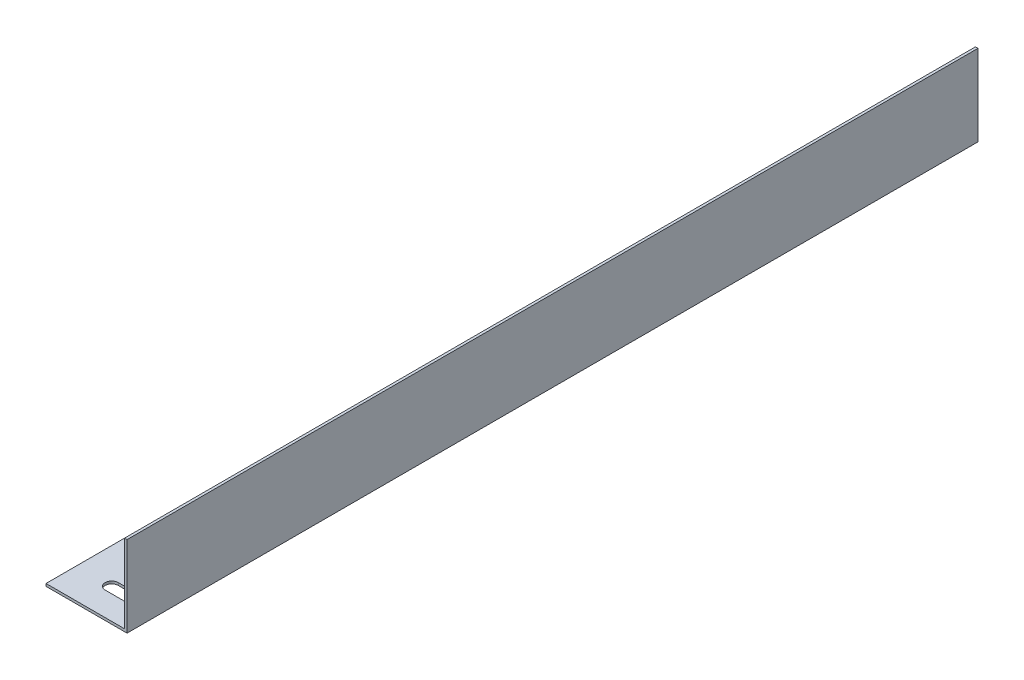
ISO-10303-21;
HEADER;
FILE_DESCRIPTION(('STEP AP214'),'2;1');
FILE_NAME('part.step','',(''),(''),'','','');
FILE_SCHEMA(('AUTOMOTIVE_DESIGN { 1 0 10303 214 1 1 1 1 }'));
ENDSEC;
DATA;
#1=APPLICATION_CONTEXT('core data for automotive mechanical design processes');
#2=APPLICATION_PROTOCOL_DEFINITION('international standard','automotive_design',2000,#1);
#3=PRODUCT_CONTEXT('',#1,'mechanical');
#4=PRODUCT('Part','Part','',(#3));
#5=PRODUCT_RELATED_PRODUCT_CATEGORY('part','',(#4));
#6=PRODUCT_DEFINITION_FORMATION('','',#4);
#7=PRODUCT_DEFINITION_CONTEXT('part definition',#1,'design');
#8=PRODUCT_DEFINITION('design','',#6,#7);
#9=PRODUCT_DEFINITION_SHAPE('','',#8);
#10=(LENGTH_UNIT() NAMED_UNIT(*) SI_UNIT(.MILLI.,.METRE.));
#11=(NAMED_UNIT(*) PLANE_ANGLE_UNIT() SI_UNIT($,.RADIAN.));
#12=(NAMED_UNIT(*) SI_UNIT($,.STERADIAN.) SOLID_ANGLE_UNIT());
#13=UNCERTAINTY_MEASURE_WITH_UNIT(LENGTH_MEASURE(1.E-05),#10,'distance_accuracy_value','');
#14=(GEOMETRIC_REPRESENTATION_CONTEXT(3) GLOBAL_UNCERTAINTY_ASSIGNED_CONTEXT((#13)) GLOBAL_UNIT_ASSIGNED_CONTEXT((#10,
#11,#12)) REPRESENTATION_CONTEXT('',''));
#15=CARTESIAN_POINT('',(0.,0.,0.));
#16=DIRECTION('',(0.,0.,1.));
#17=DIRECTION('',(1.,0.,0.));
#18=AXIS2_PLACEMENT_3D('',#15,#16,#17);
#19=CARTESIAN_POINT('',(0.,1.5875,533.4));
#20=DIRECTION('',(1.,0.,0.));
#21=DIRECTION('',(0.,1.,0.));
#22=AXIS2_PLACEMENT_3D('',#19,#20,#21);
#23=PLANE('',#22);
#24=DIRECTION('',(0.,-1.,0.));
#25=VECTOR('',#24,1.);
#26=CARTESIAN_POINT('',(0.,1.5875,0.));
#27=LINE('',#26,#25);
#28=CARTESIAN_POINT('',(0.,1.5875,0.));
#29=VERTEX_POINT('',#28);
#30=CARTESIAN_POINT('',(0.,0.,0.));
#31=VERTEX_POINT('',#30);
#32=EDGE_CURVE('E163',#29,#31,#27,.T.);
#33=ORIENTED_EDGE('',*,*,#32,.T.);
#34=DIRECTION('',(0.,0.,-1.));
#35=VECTOR('',#34,1.);
#36=CARTESIAN_POINT('',(0.,0.,533.4));
#37=LINE('',#36,#35);
#38=CARTESIAN_POINT('',(0.,0.,533.4));
#39=VERTEX_POINT('',#38);
#40=EDGE_CURVE('E189',#39,#31,#37,.T.);
#41=ORIENTED_EDGE('',*,*,#40,.F.);
#42=DIRECTION('',(0.,-1.,0.));
#43=VECTOR('',#42,1.);
#44=CARTESIAN_POINT('',(0.,1.5875,533.4));
#45=LINE('',#44,#43);
#46=CARTESIAN_POINT('',(0.,1.5875,533.4));
#47=VERTEX_POINT('',#46);
#48=EDGE_CURVE('E148',#47,#39,#45,.T.);
#49=ORIENTED_EDGE('',*,*,#48,.F.);
#50=DIRECTION('',(0.,0.,-1.));
#51=VECTOR('',#50,1.);
#52=CARTESIAN_POINT('',(0.,1.5875,533.4));
#53=LINE('',#52,#51);
#54=EDGE_CURVE('E162',#47,#29,#53,.T.);
#55=ORIENTED_EDGE('',*,*,#54,.T.);
#56=EDGE_LOOP('',(#33,#41,#49,#55));
#57=FACE_BOUND('',#56,.T.);
#58=ADVANCED_FACE('F32',(#57),#23,.F.);
#59=CARTESIAN_POINT('',(0.,0.,533.4));
#60=DIRECTION('',(0.,1.,0.));
#61=DIRECTION('',(0.,0.,1.));
#62=AXIS2_PLACEMENT_3D('',#59,#60,#61);
#63=PLANE('',#62);
#64=DIRECTION('',(1.,0.,0.));
#65=VECTOR('',#64,1.);
#66=CARTESIAN_POINT('',(22.1614999999999,0.,510.2479));
#67=LINE('',#66,#65);
#68=CARTESIAN_POINT('',(22.1614999999999,0.,510.2479));
#69=VERTEX_POINT('',#68);
#70=CARTESIAN_POINT('',(34.8614999999999,0.,510.2479));
#71=VERTEX_POINT('',#70);
#72=EDGE_CURVE('E120',#69,#71,#67,.T.);
#73=ORIENTED_EDGE('',*,*,#72,.F.);
#74=CARTESIAN_POINT('',(22.1614999999999,0.,514.35));
#75=DIRECTION('',(0.,-1.,0.));
#76=DIRECTION('',(0.,0.,-1.));
#77=AXIS2_PLACEMENT_3D('',#74,#75,#76);
#78=CIRCLE('',#77,4.10209999999989);
#79=CARTESIAN_POINT('',(22.1614999999999,0.,518.4521));
#80=VERTEX_POINT('',#79);
#81=EDGE_CURVE('E46',#80,#69,#78,.T.);
#82=ORIENTED_EDGE('',*,*,#81,.F.);
#83=DIRECTION('',(-1.,0.,0.));
#84=VECTOR('',#83,1.);
#85=CARTESIAN_POINT('',(22.1614999999999,0.,518.4521));
#86=LINE('',#85,#84);
#87=CARTESIAN_POINT('',(34.8614999999999,0.,518.4521));
#88=VERTEX_POINT('',#87);
#89=EDGE_CURVE('E127',#88,#80,#86,.T.);
#90=ORIENTED_EDGE('',*,*,#89,.F.);
#91=CARTESIAN_POINT('',(34.8614999999999,0.,514.35));
#92=DIRECTION('',(0.,-1.,0.));
#93=DIRECTION('',(0.,0.,-1.));
#94=AXIS2_PLACEMENT_3D('',#91,#92,#93);
#95=CIRCLE('',#94,4.1021);
#96=EDGE_CURVE('E111',#71,#88,#95,.T.);
#97=ORIENTED_EDGE('',*,*,#96,.F.);
#98=EDGE_LOOP('',(#73,#82,#90,#97));
#99=FACE_BOUND('',#98,.T.);
#100=CARTESIAN_POINT('',(22.1614999999999,0.,19.05));
#101=DIRECTION('',(0.,-1.,0.));
#102=DIRECTION('',(0.,0.,1.));
#103=AXIS2_PLACEMENT_3D('',#100,#101,#102);
#104=CIRCLE('',#103,4.10210000000001);
#105=CARTESIAN_POINT('',(22.1614999999999,0.,23.1521));
#106=VERTEX_POINT('',#105);
#107=EDGE_CURVE('E134',#106,#106,#104,.T.);
#108=ORIENTED_EDGE('',*,*,#107,.F.);
#109=EDGE_LOOP('',(#108));
#110=FACE_BOUND('',#109,.T.);
#111=CARTESIAN_POINT('',(22.1614999999999,0.,57.15));
#112=DIRECTION('',(0.,-1.,0.));
#113=DIRECTION('',(0.,0.,1.));
#114=AXIS2_PLACEMENT_3D('',#111,#112,#113);
#115=CIRCLE('',#114,4.10210000000001);
#116=CARTESIAN_POINT('',(22.1614999999999,0.,61.2521));
#117=VERTEX_POINT('',#116);
#118=EDGE_CURVE('E140',#117,#117,#115,.T.);
#119=ORIENTED_EDGE('',*,*,#118,.F.);
#120=EDGE_LOOP('',(#119));
#121=FACE_BOUND('',#120,.T.);
#122=CARTESIAN_POINT('',(22.1614999999999,0.,476.25));
#123=DIRECTION('',(0.,-1.,0.));
#124=DIRECTION('',(0.,0.,-1.));
#125=AXIS2_PLACEMENT_3D('',#122,#123,#124);
#126=CIRCLE('',#125,4.10210000000001);
#127=CARTESIAN_POINT('',(22.1614999999999,0.,472.1479));
#128=VERTEX_POINT('',#127);
#129=EDGE_CURVE('E144',#128,#128,#126,.T.);
#130=ORIENTED_EDGE('',*,*,#129,.F.);
#131=EDGE_LOOP('',(#130));
#132=FACE_BOUND('',#131,.T.);
#133=DIRECTION('',(1.,0.,0.));
#134=VECTOR('',#133,1.);
#135=CARTESIAN_POINT('',(0.,0.,0.));
#136=LINE('',#135,#134);
#137=CARTESIAN_POINT('',(50.8,0.,0.));
#138=VERTEX_POINT('',#137);
#139=EDGE_CURVE('E166',#31,#138,#136,.T.);
#140=ORIENTED_EDGE('',*,*,#139,.T.);
#141=DIRECTION('',(0.,0.,-1.));
#142=VECTOR('',#141,1.);
#143=CARTESIAN_POINT('',(50.8,0.,533.4));
#144=LINE('',#143,#142);
#145=CARTESIAN_POINT('',(50.8,0.,533.4));
#146=VERTEX_POINT('',#145);
#147=EDGE_CURVE('E186',#146,#138,#144,.T.);
#148=ORIENTED_EDGE('',*,*,#147,.F.);
#149=DIRECTION('',(1.,0.,0.));
#150=VECTOR('',#149,1.);
#151=CARTESIAN_POINT('',(0.,0.,533.4));
#152=LINE('',#151,#150);
#153=EDGE_CURVE('E151',#39,#146,#152,.T.);
#154=ORIENTED_EDGE('',*,*,#153,.F.);
#155=ORIENTED_EDGE('',*,*,#40,.T.);
#156=EDGE_LOOP('',(#140,#148,#154,#155));
#157=FACE_BOUND('',#156,.T.);
#158=ADVANCED_FACE('F124',(#99,#110,#121,#132,#157),#63,.F.);
#159=CARTESIAN_POINT('',(50.8,0.,533.4));
#160=DIRECTION('',(-1.,0.,0.));
#161=DIRECTION('',(0.,0.,1.));
#162=AXIS2_PLACEMENT_3D('',#159,#160,#161);
#163=PLANE('',#162);
#164=DIRECTION('',(0.,1.,0.));
#165=VECTOR('',#164,1.);
#166=CARTESIAN_POINT('',(50.8,0.,0.));
#167=LINE('',#166,#165);
#168=CARTESIAN_POINT('',(50.8,50.8,0.));
#169=VERTEX_POINT('',#168);
#170=EDGE_CURVE('E168',#138,#169,#167,.T.);
#171=ORIENTED_EDGE('',*,*,#170,.T.);
#172=DIRECTION('',(0.,0.,-1.));
#173=VECTOR('',#172,1.);
#174=CARTESIAN_POINT('',(50.8,50.8,533.4));
#175=LINE('',#174,#173);
#176=CARTESIAN_POINT('',(50.8,50.8,533.4));
#177=VERTEX_POINT('',#176);
#178=EDGE_CURVE('E183',#177,#169,#175,.T.);
#179=ORIENTED_EDGE('',*,*,#178,.F.);
#180=DIRECTION('',(0.,1.,0.));
#181=VECTOR('',#180,1.);
#182=CARTESIAN_POINT('',(50.8,0.,533.4));
#183=LINE('',#182,#181);
#184=EDGE_CURVE('E154',#146,#177,#183,.T.);
#185=ORIENTED_EDGE('',*,*,#184,.F.);
#186=ORIENTED_EDGE('',*,*,#147,.T.);
#187=EDGE_LOOP('',(#171,#179,#185,#186));
#188=FACE_BOUND('',#187,.T.);
#189=ADVANCED_FACE('F225',(#188),#163,.F.);
#190=CARTESIAN_POINT('',(50.8,50.8,533.4));
#191=DIRECTION('',(0.,-1.,0.));
#192=DIRECTION('',(0.,0.,-1.));
#193=AXIS2_PLACEMENT_3D('',#190,#191,#192);
#194=PLANE('',#193);
#195=DIRECTION('',(-1.,0.,0.));
#196=VECTOR('',#195,1.);
#197=CARTESIAN_POINT('',(50.8,50.8,0.));
#198=LINE('',#197,#196);
#199=CARTESIAN_POINT('',(49.2125,50.8,0.));
#200=VERTEX_POINT('',#199);
#201=EDGE_CURVE('E170',#169,#200,#198,.T.);
#202=ORIENTED_EDGE('',*,*,#201,.T.);
#203=DIRECTION('',(0.,0.,-1.));
#204=VECTOR('',#203,1.);
#205=CARTESIAN_POINT('',(49.2125,50.8,533.4));
#206=LINE('',#205,#204);
#207=CARTESIAN_POINT('',(49.2125,50.8,533.4));
#208=VERTEX_POINT('',#207);
#209=EDGE_CURVE('E180',#208,#200,#206,.T.);
#210=ORIENTED_EDGE('',*,*,#209,.F.);
#211=DIRECTION('',(-1.,0.,0.));
#212=VECTOR('',#211,1.);
#213=CARTESIAN_POINT('',(50.8,50.8,533.4));
#214=LINE('',#213,#212);
#215=EDGE_CURVE('E156',#177,#208,#214,.T.);
#216=ORIENTED_EDGE('',*,*,#215,.F.);
#217=ORIENTED_EDGE('',*,*,#178,.T.);
#218=EDGE_LOOP('',(#202,#210,#216,#217));
#219=FACE_BOUND('',#218,.T.);
#220=ADVANCED_FACE('F249',(#219),#194,.F.);
#221=CARTESIAN_POINT('',(49.2125,50.8,533.4));
#222=DIRECTION('',(1.,0.,0.));
#223=DIRECTION('',(0.,1.,0.));
#224=AXIS2_PLACEMENT_3D('',#221,#222,#223);
#225=PLANE('',#224);
#226=DIRECTION('',(0.,-1.,0.));
#227=VECTOR('',#226,1.);
#228=CARTESIAN_POINT('',(49.2125,50.8,0.));
#229=LINE('',#228,#227);
#230=CARTESIAN_POINT('',(49.2125,1.58750000000001,0.));
#231=VERTEX_POINT('',#230);
#232=EDGE_CURVE('E172',#200,#231,#229,.T.);
#233=ORIENTED_EDGE('',*,*,#232,.T.);
#234=DIRECTION('',(0.,0.,-1.));
#235=VECTOR('',#234,1.);
#236=CARTESIAN_POINT('',(49.2125,1.58750000000001,533.4));
#237=LINE('',#236,#235);
#238=CARTESIAN_POINT('',(49.2125,1.58750000000001,533.4));
#239=VERTEX_POINT('',#238);
#240=EDGE_CURVE('E177',#239,#231,#237,.T.);
#241=ORIENTED_EDGE('',*,*,#240,.F.);
#242=DIRECTION('',(0.,-1.,0.));
#243=VECTOR('',#242,1.);
#244=CARTESIAN_POINT('',(49.2125,50.8,533.4));
#245=LINE('',#244,#243);
#246=EDGE_CURVE('E158',#208,#239,#245,.T.);
#247=ORIENTED_EDGE('',*,*,#246,.F.);
#248=ORIENTED_EDGE('',*,*,#209,.T.);
#249=EDGE_LOOP('',(#233,#241,#247,#248));
#250=FACE_BOUND('',#249,.T.);
#251=ADVANCED_FACE('F246',(#250),#225,.F.);
#252=CARTESIAN_POINT('',(49.2125,1.58750000000001,533.4));
#253=DIRECTION('',(0.,-1.,0.));
#254=DIRECTION('',(1.,0.,0.));
#255=AXIS2_PLACEMENT_3D('',#252,#253,#254);
#256=PLANE('',#255);
#257=DIRECTION('',(-1.,0.,0.));
#258=VECTOR('',#257,1.);
#259=CARTESIAN_POINT('',(49.2125000000001,1.58750000000001,518.4521));
#260=LINE('',#259,#258);
#261=CARTESIAN_POINT('',(34.8614999999999,1.58750000000001,518.4521));
#262=VERTEX_POINT('',#261);
#263=CARTESIAN_POINT('',(22.1614999999999,1.58750000000001,518.4521));
#264=VERTEX_POINT('',#263);
#265=EDGE_CURVE('E39',#262,#264,#260,.T.);
#266=ORIENTED_EDGE('',*,*,#265,.T.);
#267=CARTESIAN_POINT('',(22.1614999999999,1.58750000000001,514.35));
#268=DIRECTION('',(0.,-1.,0.));
#269=DIRECTION('',(1.,0.,0.));
#270=AXIS2_PLACEMENT_3D('',#267,#268,#269);
#271=CIRCLE('',#270,4.10209999999989);
#272=CARTESIAN_POINT('',(22.1614999999999,1.58750000000001,510.2479));
#273=VERTEX_POINT('',#272);
#274=EDGE_CURVE('E11',#264,#273,#271,.T.);
#275=ORIENTED_EDGE('',*,*,#274,.T.);
#276=DIRECTION('',(1.,0.,0.));
#277=VECTOR('',#276,1.);
#278=CARTESIAN_POINT('',(49.2124999999998,1.58750000000001,510.2479));
#279=LINE('',#278,#277);
#280=CARTESIAN_POINT('',(34.8614999999999,1.5875,510.2479));
#281=VERTEX_POINT('',#280);
#282=EDGE_CURVE('E192',#273,#281,#279,.T.);
#283=ORIENTED_EDGE('',*,*,#282,.T.);
#284=CARTESIAN_POINT('',(34.8614999999999,1.58750000000001,514.35));
#285=DIRECTION('',(0.,-1.,0.));
#286=DIRECTION('',(1.,0.,0.));
#287=AXIS2_PLACEMENT_3D('',#284,#285,#286);
#288=CIRCLE('',#287,4.1021);
#289=EDGE_CURVE('E114',#281,#262,#288,.T.);
#290=ORIENTED_EDGE('',*,*,#289,.T.);
#291=EDGE_LOOP('',(#266,#275,#283,#290));
#292=FACE_BOUND('',#291,.T.);
#293=CARTESIAN_POINT('',(22.1614999999999,1.58750000000001,19.05));
#294=DIRECTION('',(0.,-1.,0.));
#295=DIRECTION('',(1.,0.,0.));
#296=AXIS2_PLACEMENT_3D('',#293,#294,#295);
#297=CIRCLE('',#296,4.10210000000001);
#298=CARTESIAN_POINT('',(26.2635999999999,1.58750000000001,19.05));
#299=VERTEX_POINT('',#298);
#300=EDGE_CURVE('E139',#299,#299,#297,.T.);
#301=ORIENTED_EDGE('',*,*,#300,.T.);
#302=EDGE_LOOP('',(#301));
#303=FACE_BOUND('',#302,.T.);
#304=CARTESIAN_POINT('',(22.1614999999999,1.58750000000001,57.15));
#305=DIRECTION('',(0.,-1.,0.));
#306=DIRECTION('',(1.,0.,0.));
#307=AXIS2_PLACEMENT_3D('',#304,#305,#306);
#308=CIRCLE('',#307,4.10210000000001);
#309=CARTESIAN_POINT('',(26.2636,1.58750000000001,57.15));
#310=VERTEX_POINT('',#309);
#311=EDGE_CURVE('E143',#310,#310,#308,.T.);
#312=ORIENTED_EDGE('',*,*,#311,.T.);
#313=EDGE_LOOP('',(#312));
#314=FACE_BOUND('',#313,.T.);
#315=CARTESIAN_POINT('',(22.1614999999999,1.58750000000001,476.25));
#316=DIRECTION('',(0.,-1.,0.));
#317=DIRECTION('',(1.,0.,0.));
#318=AXIS2_PLACEMENT_3D('',#315,#316,#317);
#319=CIRCLE('',#318,4.10210000000001);
#320=CARTESIAN_POINT('',(26.2636,1.58750000000001,476.25));
#321=VERTEX_POINT('',#320);
#322=EDGE_CURVE('E147',#321,#321,#319,.T.);
#323=ORIENTED_EDGE('',*,*,#322,.T.);
#324=EDGE_LOOP('',(#323));
#325=FACE_BOUND('',#324,.T.);
#326=DIRECTION('',(-1.,0.,0.));
#327=VECTOR('',#326,1.);
#328=CARTESIAN_POINT('',(49.2125,1.58750000000001,0.));
#329=LINE('',#328,#327);
#330=EDGE_CURVE('E152',#231,#29,#329,.T.);
#331=ORIENTED_EDGE('',*,*,#330,.T.);
#332=ORIENTED_EDGE('',*,*,#54,.F.);
#333=DIRECTION('',(-1.,0.,0.));
#334=VECTOR('',#333,1.);
#335=CARTESIAN_POINT('',(49.2125,1.58750000000001,533.4));
#336=LINE('',#335,#334);
#337=EDGE_CURVE('E160',#239,#47,#336,.T.);
#338=ORIENTED_EDGE('',*,*,#337,.F.);
#339=ORIENTED_EDGE('',*,*,#240,.T.);
#340=EDGE_LOOP('',(#331,#332,#338,#339));
#341=FACE_BOUND('',#340,.T.);
#342=ADVANCED_FACE('F202',(#292,#303,#314,#325,#341),#256,.F.);
#343=CARTESIAN_POINT('',(0.,0.,533.4));
#344=DIRECTION('',(0.,0.,1.));
#345=DIRECTION('',(1.,0.,0.));
#346=AXIS2_PLACEMENT_3D('',#343,#344,#345);
#347=PLANE('',#346);
#348=ORIENTED_EDGE('',*,*,#48,.T.);
#349=ORIENTED_EDGE('',*,*,#153,.T.);
#350=ORIENTED_EDGE('',*,*,#184,.T.);
#351=ORIENTED_EDGE('',*,*,#215,.T.);
#352=ORIENTED_EDGE('',*,*,#246,.T.);
#353=ORIENTED_EDGE('',*,*,#337,.T.);
#354=EDGE_LOOP('',(#348,#349,#350,#351,#352,#353));
#355=FACE_BOUND('',#354,.T.);
#356=ADVANCED_FACE('F240',(#355),#347,.T.);
#357=CARTESIAN_POINT('',(0.,0.,0.));
#358=DIRECTION('',(0.,0.,1.));
#359=DIRECTION('',(1.,0.,0.));
#360=AXIS2_PLACEMENT_3D('',#357,#358,#359);
#361=PLANE('',#360);
#362=ORIENTED_EDGE('',*,*,#32,.F.);
#363=ORIENTED_EDGE('',*,*,#330,.F.);
#364=ORIENTED_EDGE('',*,*,#232,.F.);
#365=ORIENTED_EDGE('',*,*,#201,.F.);
#366=ORIENTED_EDGE('',*,*,#170,.F.);
#367=ORIENTED_EDGE('',*,*,#139,.F.);
#368=EDGE_LOOP('',(#362,#363,#364,#365,#366,#367));
#369=FACE_BOUND('',#368,.T.);
#370=ADVANCED_FACE('F232',(#369),#361,.F.);
#371=CARTESIAN_POINT('',(22.1614999999999,50.8,476.25));
#372=DIRECTION('',(0.,-1.,0.));
#373=DIRECTION('',(0.,0.,-1.));
#374=AXIS2_PLACEMENT_3D('',#371,#372,#373);
#375=CYLINDRICAL_SURFACE('',#374,4.10210000000001);
#376=ORIENTED_EDGE('',*,*,#129,.T.);
#377=EDGE_LOOP('',(#376));
#378=FACE_BOUND('',#377,.T.);
#379=ORIENTED_EDGE('',*,*,#322,.F.);
#380=EDGE_LOOP('',(#379));
#381=FACE_BOUND('',#380,.T.);
#382=ADVANCED_FACE('F266',(#378,#381),#375,.F.);
#383=CARTESIAN_POINT('',(22.1614999999999,50.8,57.15));
#384=DIRECTION('',(0.,-1.,0.));
#385=DIRECTION('',(0.,0.,-1.));
#386=AXIS2_PLACEMENT_3D('',#383,#384,#385);
#387=CYLINDRICAL_SURFACE('',#386,4.10210000000001);
#388=ORIENTED_EDGE('',*,*,#118,.T.);
#389=EDGE_LOOP('',(#388));
#390=FACE_BOUND('',#389,.T.);
#391=ORIENTED_EDGE('',*,*,#311,.F.);
#392=EDGE_LOOP('',(#391));
#393=FACE_BOUND('',#392,.T.);
#394=ADVANCED_FACE('F216',(#390,#393),#387,.F.);
#395=CARTESIAN_POINT('',(22.1614999999999,50.8,19.05));
#396=DIRECTION('',(0.,-1.,0.));
#397=DIRECTION('',(0.,0.,-1.));
#398=AXIS2_PLACEMENT_3D('',#395,#396,#397);
#399=CYLINDRICAL_SURFACE('',#398,4.10210000000001);
#400=ORIENTED_EDGE('',*,*,#107,.T.);
#401=EDGE_LOOP('',(#400));
#402=FACE_BOUND('',#401,.T.);
#403=ORIENTED_EDGE('',*,*,#300,.F.);
#404=EDGE_LOOP('',(#403));
#405=FACE_BOUND('',#404,.T.);
#406=ADVANCED_FACE('F209',(#402,#405),#399,.F.);
#407=CARTESIAN_POINT('',(22.1614999999999,50.8,514.35));
#408=DIRECTION('',(0.,-1.,0.));
#409=DIRECTION('',(0.,0.,-1.));
#410=AXIS2_PLACEMENT_3D('',#407,#408,#409);
#411=CYLINDRICAL_SURFACE('',#410,4.10209999999989);
#412=DIRECTION('',(0.,-1.,0.));
#413=VECTOR('',#412,1.);
#414=CARTESIAN_POINT('',(22.1614999999999,50.8,518.4521));
#415=LINE('',#414,#413);
#416=EDGE_CURVE('E132',#264,#80,#415,.T.);
#417=ORIENTED_EDGE('',*,*,#416,.T.);
#418=ORIENTED_EDGE('',*,*,#81,.T.);
#419=DIRECTION('',(0.,-1.,0.));
#420=VECTOR('',#419,1.);
#421=CARTESIAN_POINT('',(22.1614999999999,50.8,510.2479));
#422=LINE('',#421,#420);
#423=EDGE_CURVE('E117',#273,#69,#422,.T.);
#424=ORIENTED_EDGE('',*,*,#423,.F.);
#425=ORIENTED_EDGE('',*,*,#274,.F.);
#426=EDGE_LOOP('',(#417,#418,#424,#425));
#427=FACE_BOUND('',#426,.T.);
#428=ADVANCED_FACE('F207',(#427),#411,.F.);
#429=CARTESIAN_POINT('',(22.1614999999999,50.8,518.4521));
#430=DIRECTION('',(0.,0.,1.));
#431=DIRECTION('',(1.,0.,0.));
#432=AXIS2_PLACEMENT_3D('',#429,#430,#431);
#433=PLANE('',#432);
#434=DIRECTION('',(0.,-1.,0.));
#435=VECTOR('',#434,1.);
#436=CARTESIAN_POINT('',(34.8614999999999,50.8,518.4521));
#437=LINE('',#436,#435);
#438=EDGE_CURVE('E116',#262,#88,#437,.T.);
#439=ORIENTED_EDGE('',*,*,#438,.T.);
#440=ORIENTED_EDGE('',*,*,#89,.T.);
#441=ORIENTED_EDGE('',*,*,#416,.F.);
#442=ORIENTED_EDGE('',*,*,#265,.F.);
#443=EDGE_LOOP('',(#439,#440,#441,#442));
#444=FACE_BOUND('',#443,.T.);
#445=ADVANCED_FACE('F206',(#444),#433,.F.);
#446=CARTESIAN_POINT('',(34.8614999999999,50.8,514.35));
#447=DIRECTION('',(0.,-1.,0.));
#448=DIRECTION('',(0.,0.,-1.));
#449=AXIS2_PLACEMENT_3D('',#446,#447,#448);
#450=CYLINDRICAL_SURFACE('',#449,4.1021);
#451=DIRECTION('',(0.,-1.,0.));
#452=VECTOR('',#451,1.);
#453=CARTESIAN_POINT('',(34.8614999999999,50.8,510.2479));
#454=LINE('',#453,#452);
#455=EDGE_CURVE('E54',#281,#71,#454,.T.);
#456=ORIENTED_EDGE('',*,*,#455,.T.);
#457=ORIENTED_EDGE('',*,*,#96,.T.);
#458=ORIENTED_EDGE('',*,*,#438,.F.);
#459=ORIENTED_EDGE('',*,*,#289,.F.);
#460=EDGE_LOOP('',(#456,#457,#458,#459));
#461=FACE_BOUND('',#460,.T.);
#462=ADVANCED_FACE('F108',(#461),#450,.F.);
#463=CARTESIAN_POINT('',(22.1614999999999,50.8,510.2479));
#464=DIRECTION('',(0.,0.,-1.));
#465=DIRECTION('',(-1.,0.,0.));
#466=AXIS2_PLACEMENT_3D('',#463,#464,#465);
#467=PLANE('',#466);
#468=ORIENTED_EDGE('',*,*,#423,.T.);
#469=ORIENTED_EDGE('',*,*,#72,.T.);
#470=ORIENTED_EDGE('',*,*,#455,.F.);
#471=ORIENTED_EDGE('',*,*,#282,.F.);
#472=EDGE_LOOP('',(#468,#469,#470,#471));
#473=FACE_BOUND('',#472,.T.);
#474=ADVANCED_FACE('F121',(#473),#467,.F.);
#475=CLOSED_SHELL('',(#58,#158,#189,#220,#251,#342,#356,#370,#382,#394,#406,#428,#445,#462,#474));
#476=MANIFOLD_SOLID_BREP('B2',#475);
#477=ADVANCED_BREP_SHAPE_REPRESENTATION('',(#18,#476),#14);
#478=SHAPE_DEFINITION_REPRESENTATION(#9,#477);
ENDSEC;
END-ISO-10303-21;
